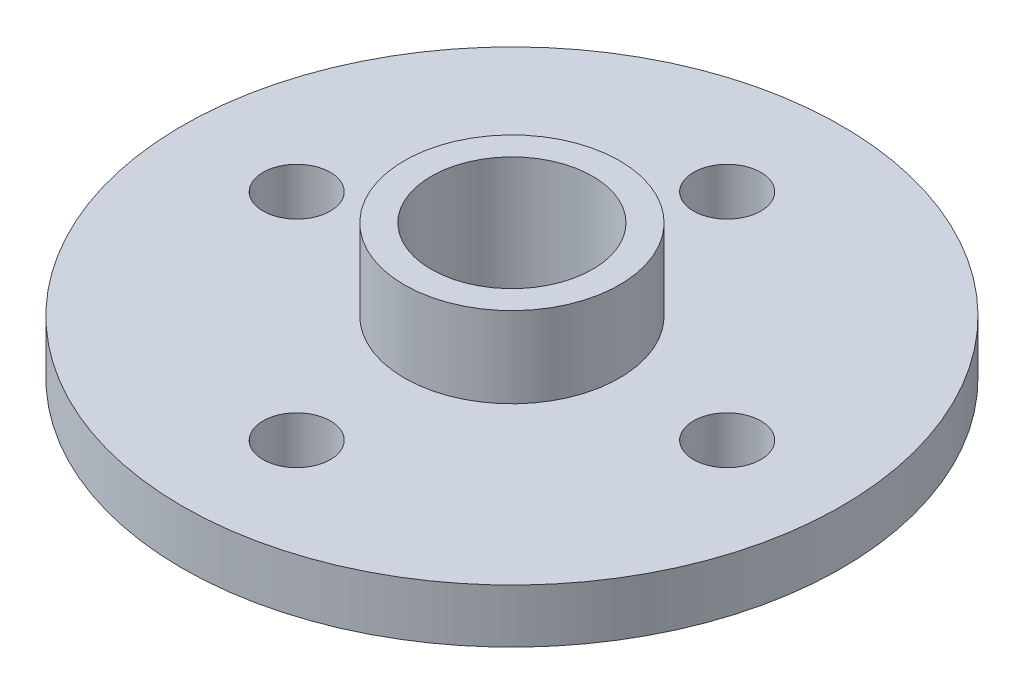
ISO-10303-21;
HEADER;
FILE_DESCRIPTION(('STEP AP214'),'2;1');
FILE_NAME('part.step','',(''),(''),'','','');
FILE_SCHEMA(('AUTOMOTIVE_DESIGN { 1 0 10303 214 1 1 1 1 }'));
ENDSEC;
DATA;
#1=APPLICATION_CONTEXT('core data for automotive mechanical design processes');
#2=APPLICATION_PROTOCOL_DEFINITION('international standard','automotive_design',2000,#1);
#3=PRODUCT_CONTEXT('',#1,'mechanical');
#4=PRODUCT('Part','Part','',(#3));
#5=PRODUCT_RELATED_PRODUCT_CATEGORY('part','',(#4));
#6=PRODUCT_DEFINITION_FORMATION('','',#4);
#7=PRODUCT_DEFINITION_CONTEXT('part definition',#1,'design');
#8=PRODUCT_DEFINITION('design','',#6,#7);
#9=PRODUCT_DEFINITION_SHAPE('','',#8);
#10=(LENGTH_UNIT() NAMED_UNIT(*) SI_UNIT(.MILLI.,.METRE.));
#11=(NAMED_UNIT(*) PLANE_ANGLE_UNIT() SI_UNIT($,.RADIAN.));
#12=(NAMED_UNIT(*) SI_UNIT($,.STERADIAN.) SOLID_ANGLE_UNIT());
#13=UNCERTAINTY_MEASURE_WITH_UNIT(LENGTH_MEASURE(1.E-05),#10,'distance_accuracy_value','');
#14=(GEOMETRIC_REPRESENTATION_CONTEXT(3) GLOBAL_UNCERTAINTY_ASSIGNED_CONTEXT((#13)) GLOBAL_UNIT_ASSIGNED_CONTEXT((#10,
#11,#12)) REPRESENTATION_CONTEXT('',''));
#15=CARTESIAN_POINT('',(0.,0.,0.));
#16=DIRECTION('',(0.,0.,1.));
#17=DIRECTION('',(1.,0.,0.));
#18=AXIS2_PLACEMENT_3D('',#15,#16,#17);
#19=CARTESIAN_POINT('',(0.,2.,0.));
#20=DIRECTION('',(0.,1.,0.));
#21=DIRECTION('',(0.,0.,1.));
#22=AXIS2_PLACEMENT_3D('',#19,#20,#21);
#23=PLANE('',#22);
#24=CARTESIAN_POINT('',(0.,2.,-8.));
#25=DIRECTION('',(0.,1.,0.));
#26=DIRECTION('',(0.,0.,1.));
#27=AXIS2_PLACEMENT_3D('',#24,#25,#26);
#28=CIRCLE('',#27,1.25);
#29=CARTESIAN_POINT('',(0.,2.,-6.75));
#30=VERTEX_POINT('',#29);
#31=EDGE_CURVE('E76',#30,#30,#28,.T.);
#32=ORIENTED_EDGE('',*,*,#31,.F.);
#33=EDGE_LOOP('',(#32));
#34=FACE_BOUND('',#33,.T.);
#35=CARTESIAN_POINT('',(0.,2.,8.));
#36=DIRECTION('',(0.,1.,0.));
#37=DIRECTION('',(0.,0.,1.));
#38=AXIS2_PLACEMENT_3D('',#35,#36,#37);
#39=CIRCLE('',#38,1.25);
#40=CARTESIAN_POINT('',(0.,2.,9.25));
#41=VERTEX_POINT('',#40);
#42=EDGE_CURVE('E60',#41,#41,#39,.T.);
#43=ORIENTED_EDGE('',*,*,#42,.F.);
#44=EDGE_LOOP('',(#43));
#45=FACE_BOUND('',#44,.T.);
#46=CARTESIAN_POINT('',(0.,2.,0.));
#47=DIRECTION('',(0.,1.,0.));
#48=DIRECTION('',(0.,0.,1.));
#49=AXIS2_PLACEMENT_3D('',#46,#47,#48);
#50=CIRCLE('',#49,12.25);
#51=CARTESIAN_POINT('',(0.,2.,12.25));
#52=VERTEX_POINT('',#51);
#53=EDGE_CURVE('E10',#52,#52,#50,.T.);
#54=ORIENTED_EDGE('',*,*,#53,.T.);
#55=EDGE_LOOP('',(#54));
#56=FACE_BOUND('',#55,.T.);
#57=CARTESIAN_POINT('',(8.,2.,0.));
#58=DIRECTION('',(0.,1.,0.));
#59=DIRECTION('',(0.,0.,1.));
#60=AXIS2_PLACEMENT_3D('',#57,#58,#59);
#61=CIRCLE('',#60,1.25);
#62=CARTESIAN_POINT('',(8.,2.,1.25));
#63=VERTEX_POINT('',#62);
#64=EDGE_CURVE('E55',#63,#63,#61,.T.);
#65=ORIENTED_EDGE('',*,*,#64,.F.);
#66=EDGE_LOOP('',(#65));
#67=FACE_BOUND('',#66,.T.);
#68=CARTESIAN_POINT('',(-8.,2.,0.));
#69=DIRECTION('',(0.,1.,0.));
#70=DIRECTION('',(0.,0.,1.));
#71=AXIS2_PLACEMENT_3D('',#68,#69,#70);
#72=CIRCLE('',#71,1.25);
#73=CARTESIAN_POINT('',(-8.,2.,1.24999999999994));
#74=VERTEX_POINT('',#73);
#75=EDGE_CURVE('E68',#74,#74,#72,.T.);
#76=ORIENTED_EDGE('',*,*,#75,.F.);
#77=EDGE_LOOP('',(#76));
#78=FACE_BOUND('',#77,.T.);
#79=CARTESIAN_POINT('',(0.,2.,0.));
#80=DIRECTION('',(0.,1.,0.));
#81=DIRECTION('',(0.,0.,1.));
#82=AXIS2_PLACEMENT_3D('',#79,#80,#81);
#83=CIRCLE('',#82,4.);
#84=CARTESIAN_POINT('',(0.,2.,4.));
#85=VERTEX_POINT('',#84);
#86=EDGE_CURVE('E88',#85,#85,#83,.T.);
#87=ORIENTED_EDGE('',*,*,#86,.F.);
#88=EDGE_LOOP('',(#87));
#89=FACE_BOUND('',#88,.T.);
#90=ADVANCED_FACE('F37',(#34,#45,#56,#67,#78,#89),#23,.T.);
#91=CARTESIAN_POINT('',(0.,0.,0.));
#92=DIRECTION('',(0.,1.,0.));
#93=DIRECTION('',(0.,0.,1.));
#94=AXIS2_PLACEMENT_3D('',#91,#92,#93);
#95=PLANE('',#94);
#96=CARTESIAN_POINT('',(0.,0.,0.));
#97=DIRECTION('',(0.,1.,0.));
#98=DIRECTION('',(0.,0.,1.));
#99=AXIS2_PLACEMENT_3D('',#96,#97,#98);
#100=CIRCLE('',#99,12.25);
#101=CARTESIAN_POINT('',(0.,0.,12.25));
#102=VERTEX_POINT('',#101);
#103=EDGE_CURVE('E41',#102,#102,#100,.T.);
#104=ORIENTED_EDGE('',*,*,#103,.F.);
#105=EDGE_LOOP('',(#104));
#106=FACE_BOUND('',#105,.T.);
#107=CARTESIAN_POINT('',(0.,0.,0.));
#108=DIRECTION('',(0.,1.,0.));
#109=DIRECTION('',(0.,0.,1.));
#110=AXIS2_PLACEMENT_3D('',#107,#108,#109);
#111=CIRCLE('',#110,3.);
#112=CARTESIAN_POINT('',(0.,0.,3.));
#113=VERTEX_POINT('',#112);
#114=EDGE_CURVE('E50',#113,#113,#111,.T.);
#115=ORIENTED_EDGE('',*,*,#114,.T.);
#116=EDGE_LOOP('',(#115));
#117=FACE_BOUND('',#116,.T.);
#118=CARTESIAN_POINT('',(8.,0.,0.));
#119=DIRECTION('',(0.,1.,0.));
#120=DIRECTION('',(0.,0.,1.));
#121=AXIS2_PLACEMENT_3D('',#118,#119,#120);
#122=CIRCLE('',#121,1.25);
#123=CARTESIAN_POINT('',(8.,0.,1.25));
#124=VERTEX_POINT('',#123);
#125=EDGE_CURVE('E56',#124,#124,#122,.T.);
#126=ORIENTED_EDGE('',*,*,#125,.T.);
#127=EDGE_LOOP('',(#126));
#128=FACE_BOUND('',#127,.T.);
#129=CARTESIAN_POINT('',(0.,0.,8.));
#130=DIRECTION('',(0.,1.,0.));
#131=DIRECTION('',(0.,0.,1.));
#132=AXIS2_PLACEMENT_3D('',#129,#130,#131);
#133=CIRCLE('',#132,1.25);
#134=CARTESIAN_POINT('',(0.,0.,9.25));
#135=VERTEX_POINT('',#134);
#136=EDGE_CURVE('E64',#135,#135,#133,.T.);
#137=ORIENTED_EDGE('',*,*,#136,.T.);
#138=EDGE_LOOP('',(#137));
#139=FACE_BOUND('',#138,.T.);
#140=CARTESIAN_POINT('',(-8.,0.,0.));
#141=DIRECTION('',(0.,1.,0.));
#142=DIRECTION('',(0.,0.,1.));
#143=AXIS2_PLACEMENT_3D('',#140,#141,#142);
#144=CIRCLE('',#143,1.25);
#145=CARTESIAN_POINT('',(-8.,0.,1.24999999999994));
#146=VERTEX_POINT('',#145);
#147=EDGE_CURVE('E72',#146,#146,#144,.T.);
#148=ORIENTED_EDGE('',*,*,#147,.T.);
#149=EDGE_LOOP('',(#148));
#150=FACE_BOUND('',#149,.T.);
#151=CARTESIAN_POINT('',(0.,0.,-8.));
#152=DIRECTION('',(0.,1.,0.));
#153=DIRECTION('',(0.,0.,1.));
#154=AXIS2_PLACEMENT_3D('',#151,#152,#153);
#155=CIRCLE('',#154,1.25);
#156=CARTESIAN_POINT('',(0.,0.,-6.75));
#157=VERTEX_POINT('',#156);
#158=EDGE_CURVE('E80',#157,#157,#155,.T.);
#159=ORIENTED_EDGE('',*,*,#158,.T.);
#160=EDGE_LOOP('',(#159));
#161=FACE_BOUND('',#160,.T.);
#162=ADVANCED_FACE('F118',(#106,#117,#128,#139,#150,#161),#95,.F.);
#163=CARTESIAN_POINT('',(0.,2.,0.));
#164=DIRECTION('',(0.,-1.,0.));
#165=DIRECTION('',(0.,0.,-1.));
#166=AXIS2_PLACEMENT_3D('',#163,#164,#165);
#167=CYLINDRICAL_SURFACE('',#166,12.25);
#168=ORIENTED_EDGE('',*,*,#53,.F.);
#169=EDGE_LOOP('',(#168));
#170=FACE_BOUND('',#169,.T.);
#171=ORIENTED_EDGE('',*,*,#103,.T.);
#172=EDGE_LOOP('',(#171));
#173=FACE_BOUND('',#172,.T.);
#174=ADVANCED_FACE('F39',(#170,#173),#167,.T.);
#175=CARTESIAN_POINT('',(0.,2.,0.));
#176=DIRECTION('',(0.,-1.,0.));
#177=DIRECTION('',(0.,0.,-1.));
#178=AXIS2_PLACEMENT_3D('',#175,#176,#177);
#179=CYLINDRICAL_SURFACE('',#178,3.);
#180=ORIENTED_EDGE('',*,*,#114,.F.);
#181=EDGE_LOOP('',(#180));
#182=FACE_BOUND('',#181,.T.);
#183=CARTESIAN_POINT('',(0.,5.,0.));
#184=DIRECTION('',(0.,1.,0.));
#185=DIRECTION('',(0.,0.,1.));
#186=AXIS2_PLACEMENT_3D('',#183,#184,#185);
#187=CIRCLE('',#186,3.);
#188=CARTESIAN_POINT('',(0.,5.,3.));
#189=VERTEX_POINT('',#188);
#190=EDGE_CURVE('E92',#189,#189,#187,.T.);
#191=ORIENTED_EDGE('',*,*,#190,.T.);
#192=EDGE_LOOP('',(#191));
#193=FACE_BOUND('',#192,.T.);
#194=ADVANCED_FACE('F100',(#182,#193),#179,.F.);
#195=CARTESIAN_POINT('',(8.,2.,0.));
#196=DIRECTION('',(0.,-1.,0.));
#197=DIRECTION('',(0.,0.,-1.));
#198=AXIS2_PLACEMENT_3D('',#195,#196,#197);
#199=CYLINDRICAL_SURFACE('',#198,1.25);
#200=ORIENTED_EDGE('',*,*,#64,.T.);
#201=EDGE_LOOP('',(#200));
#202=FACE_BOUND('',#201,.T.);
#203=ORIENTED_EDGE('',*,*,#125,.F.);
#204=EDGE_LOOP('',(#203));
#205=FACE_BOUND('',#204,.T.);
#206=ADVANCED_FACE('F130',(#202,#205),#199,.F.);
#207=CARTESIAN_POINT('',(0.,2.,8.));
#208=DIRECTION('',(0.,-1.,0.));
#209=DIRECTION('',(0.,0.,-1.));
#210=AXIS2_PLACEMENT_3D('',#207,#208,#209);
#211=CYLINDRICAL_SURFACE('',#210,1.25);
#212=ORIENTED_EDGE('',*,*,#42,.T.);
#213=EDGE_LOOP('',(#212));
#214=FACE_BOUND('',#213,.T.);
#215=ORIENTED_EDGE('',*,*,#136,.F.);
#216=EDGE_LOOP('',(#215));
#217=FACE_BOUND('',#216,.T.);
#218=ADVANCED_FACE('F134',(#214,#217),#211,.F.);
#219=CARTESIAN_POINT('',(-8.,2.,0.));
#220=DIRECTION('',(0.,-1.,0.));
#221=DIRECTION('',(0.,0.,-1.));
#222=AXIS2_PLACEMENT_3D('',#219,#220,#221);
#223=CYLINDRICAL_SURFACE('',#222,1.25);
#224=ORIENTED_EDGE('',*,*,#75,.T.);
#225=EDGE_LOOP('',(#224));
#226=FACE_BOUND('',#225,.T.);
#227=ORIENTED_EDGE('',*,*,#147,.F.);
#228=EDGE_LOOP('',(#227));
#229=FACE_BOUND('',#228,.T.);
#230=ADVANCED_FACE('F114',(#226,#229),#223,.F.);
#231=CARTESIAN_POINT('',(0.,2.,-8.));
#232=DIRECTION('',(0.,-1.,0.));
#233=DIRECTION('',(0.,0.,-1.));
#234=AXIS2_PLACEMENT_3D('',#231,#232,#233);
#235=CYLINDRICAL_SURFACE('',#234,1.25);
#236=ORIENTED_EDGE('',*,*,#31,.T.);
#237=EDGE_LOOP('',(#236));
#238=FACE_BOUND('',#237,.T.);
#239=ORIENTED_EDGE('',*,*,#158,.F.);
#240=EDGE_LOOP('',(#239));
#241=FACE_BOUND('',#240,.T.);
#242=ADVANCED_FACE('F105',(#238,#241),#235,.F.);
#243=CARTESIAN_POINT('',(0.,5.,0.));
#244=DIRECTION('',(0.,1.,0.));
#245=DIRECTION('',(0.,0.,1.));
#246=AXIS2_PLACEMENT_3D('',#243,#244,#245);
#247=PLANE('',#246);
#248=CARTESIAN_POINT('',(0.,5.,0.));
#249=DIRECTION('',(0.,1.,0.));
#250=DIRECTION('',(0.,0.,1.));
#251=AXIS2_PLACEMENT_3D('',#248,#249,#250);
#252=CIRCLE('',#251,4.);
#253=CARTESIAN_POINT('',(0.,5.,4.));
#254=VERTEX_POINT('',#253);
#255=EDGE_CURVE('E84',#254,#254,#252,.T.);
#256=ORIENTED_EDGE('',*,*,#255,.T.);
#257=EDGE_LOOP('',(#256));
#258=FACE_BOUND('',#257,.T.);
#259=ORIENTED_EDGE('',*,*,#190,.F.);
#260=EDGE_LOOP('',(#259));
#261=FACE_BOUND('',#260,.T.);
#262=ADVANCED_FACE('F102',(#258,#261),#247,.T.);
#263=CARTESIAN_POINT('',(0.,5.,0.));
#264=DIRECTION('',(0.,-1.,0.));
#265=DIRECTION('',(0.,0.,-1.));
#266=AXIS2_PLACEMENT_3D('',#263,#264,#265);
#267=CYLINDRICAL_SURFACE('',#266,4.);
#268=ORIENTED_EDGE('',*,*,#255,.F.);
#269=EDGE_LOOP('',(#268));
#270=FACE_BOUND('',#269,.T.);
#271=ORIENTED_EDGE('',*,*,#86,.T.);
#272=EDGE_LOOP('',(#271));
#273=FACE_BOUND('',#272,.T.);
#274=ADVANCED_FACE('F104',(#270,#273),#267,.T.);
#275=CLOSED_SHELL('',(#90,#162,#174,#194,#206,#218,#230,#242,#262,#274));
#276=MANIFOLD_SOLID_BREP('B2',#275);
#277=ADVANCED_BREP_SHAPE_REPRESENTATION('',(#18,#276),#14);
#278=SHAPE_DEFINITION_REPRESENTATION(#9,#277);
ENDSEC;
END-ISO-10303-21;
